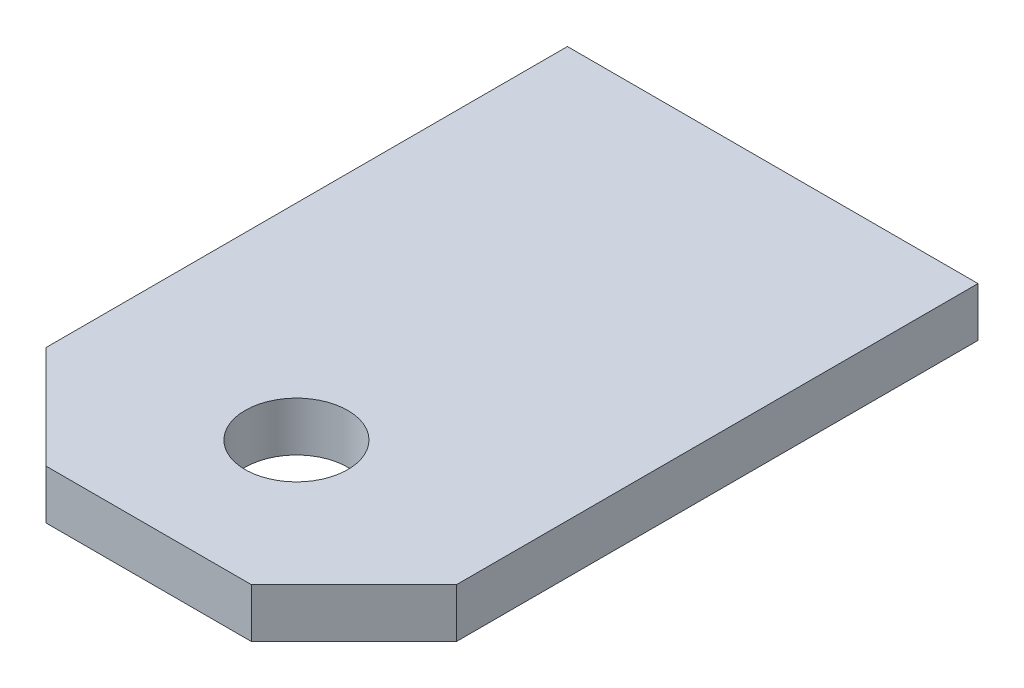
ISO-10303-21;
HEADER;
FILE_DESCRIPTION(('STEP AP214'),'2;1');
FILE_NAME('part.step','',(''),(''),'','','');
FILE_SCHEMA(('AUTOMOTIVE_DESIGN { 1 0 10303 214 1 1 1 1 }'));
ENDSEC;
DATA;
#1=APPLICATION_CONTEXT('core data for automotive mechanical design processes');
#2=APPLICATION_PROTOCOL_DEFINITION('international standard','automotive_design',2000,#1);
#3=PRODUCT_CONTEXT('',#1,'mechanical');
#4=PRODUCT('Part','Part','',(#3));
#5=PRODUCT_RELATED_PRODUCT_CATEGORY('part','',(#4));
#6=PRODUCT_DEFINITION_FORMATION('','',#4);
#7=PRODUCT_DEFINITION_CONTEXT('part definition',#1,'design');
#8=PRODUCT_DEFINITION('design','',#6,#7);
#9=PRODUCT_DEFINITION_SHAPE('','',#8);
#10=(LENGTH_UNIT() NAMED_UNIT(*) SI_UNIT(.MILLI.,.METRE.));
#11=(NAMED_UNIT(*) PLANE_ANGLE_UNIT() SI_UNIT($,.RADIAN.));
#12=(NAMED_UNIT(*) SI_UNIT($,.STERADIAN.) SOLID_ANGLE_UNIT());
#13=UNCERTAINTY_MEASURE_WITH_UNIT(LENGTH_MEASURE(1.E-05),#10,'distance_accuracy_value','');
#14=(GEOMETRIC_REPRESENTATION_CONTEXT(3) GLOBAL_UNCERTAINTY_ASSIGNED_CONTEXT((#13)) GLOBAL_UNIT_ASSIGNED_CONTEXT((#10,
#11,#12)) REPRESENTATION_CONTEXT('',''));
#15=CARTESIAN_POINT('',(0.,0.,0.));
#16=DIRECTION('',(0.,0.,1.));
#17=DIRECTION('',(1.,0.,0.));
#18=AXIS2_PLACEMENT_3D('',#15,#16,#17);
#19=CARTESIAN_POINT('',(0.,0.,2.54));
#20=DIRECTION('',(0.,-1.,0.));
#21=DIRECTION('',(1.,0.,0.));
#22=AXIS2_PLACEMENT_3D('',#19,#20,#21);
#23=CYLINDRICAL_SURFACE('',#22,0.79375);
#24=CARTESIAN_POINT('',(0.,0.762,2.54));
#25=DIRECTION('',(0.,-1.,0.));
#26=DIRECTION('',(1.,0.,0.));
#27=AXIS2_PLACEMENT_3D('',#24,#25,#26);
#28=CIRCLE('',#27,0.79375);
#29=CARTESIAN_POINT('',(-0.79375,0.762,2.54));
#30=VERTEX_POINT('',#29);
#31=EDGE_CURVE('E34',#30,#30,#28,.T.);
#32=ORIENTED_EDGE('',*,*,#31,.F.);
#33=EDGE_LOOP('',(#32));
#34=FACE_BOUND('',#33,.T.);
#35=CARTESIAN_POINT('',(0.,0.,2.54));
#36=DIRECTION('',(0.,1.,0.));
#37=DIRECTION('',(1.,0.,0.));
#38=AXIS2_PLACEMENT_3D('',#35,#36,#37);
#39=CIRCLE('',#38,0.79375);
#40=CARTESIAN_POINT('',(-0.79375,0.,2.54));
#41=VERTEX_POINT('',#40);
#42=EDGE_CURVE('E137',#41,#41,#39,.T.);
#43=ORIENTED_EDGE('',*,*,#42,.F.);
#44=EDGE_LOOP('',(#43));
#45=FACE_BOUND('',#44,.T.);
#46=ADVANCED_FACE('F16',(#34,#45),#23,.F.);
#47=CARTESIAN_POINT('',(3.175,0.,3.2385));
#48=DIRECTION('',(1.,0.,0.));
#49=DIRECTION('',(0.,0.,-1.));
#50=AXIS2_PLACEMENT_3D('',#47,#48,#49);
#51=PLANE('',#50);
#52=DIRECTION('',(0.,0.,-1.));
#53=VECTOR('',#52,1.);
#54=CARTESIAN_POINT('',(3.175,0.,3.2385));
#55=LINE('',#54,#53);
#56=CARTESIAN_POINT('',(3.175,0.,3.2385));
#57=VERTEX_POINT('',#56);
#58=CARTESIAN_POINT('',(3.175,0.,-4.826));
#59=VERTEX_POINT('',#58);
#60=EDGE_CURVE('E11',#57,#59,#55,.T.);
#61=ORIENTED_EDGE('',*,*,#60,.T.);
#62=DIRECTION('',(0.,1.,0.));
#63=VECTOR('',#62,1.);
#64=CARTESIAN_POINT('',(3.175,0.,-4.826));
#65=LINE('',#64,#63);
#66=CARTESIAN_POINT('',(3.175,0.762,-4.826));
#67=VERTEX_POINT('',#66);
#68=EDGE_CURVE('E27',#59,#67,#65,.T.);
#69=ORIENTED_EDGE('',*,*,#68,.T.);
#70=DIRECTION('',(0.,0.,-1.));
#71=VECTOR('',#70,1.);
#72=CARTESIAN_POINT('',(3.175,0.762,3.2385));
#73=LINE('',#72,#71);
#74=CARTESIAN_POINT('',(3.175,0.762,3.2385));
#75=VERTEX_POINT('',#74);
#76=EDGE_CURVE('E81',#75,#67,#73,.T.);
#77=ORIENTED_EDGE('',*,*,#76,.F.);
#78=DIRECTION('',(0.,1.,0.));
#79=VECTOR('',#78,1.);
#80=CARTESIAN_POINT('',(3.175,0.,3.2385));
#81=LINE('',#80,#79);
#82=EDGE_CURVE('E132',#57,#75,#81,.T.);
#83=ORIENTED_EDGE('',*,*,#82,.F.);
#84=EDGE_LOOP('',(#61,#69,#77,#83));
#85=FACE_BOUND('',#84,.T.);
#86=ADVANCED_FACE('F162',(#85),#51,.T.);
#87=CARTESIAN_POINT('',(1.5875,0.,4.826));
#88=DIRECTION('',(0.707106781186548,0.,0.707106781186547));
#89=DIRECTION('',(0.707106781186547,0.,-0.707106781186548));
#90=AXIS2_PLACEMENT_3D('',#87,#88,#89);
#91=PLANE('',#90);
#92=DIRECTION('',(0.707106781186548,0.,-0.707106781186548));
#93=VECTOR('',#92,1.);
#94=CARTESIAN_POINT('',(1.5875,0.,4.826));
#95=LINE('',#94,#93);
#96=CARTESIAN_POINT('',(1.5875,0.,4.826));
#97=VERTEX_POINT('',#96);
#98=EDGE_CURVE('E130',#97,#57,#95,.T.);
#99=ORIENTED_EDGE('',*,*,#98,.T.);
#100=ORIENTED_EDGE('',*,*,#82,.T.);
#101=DIRECTION('',(0.707106781186548,0.,-0.707106781186548));
#102=VECTOR('',#101,1.);
#103=CARTESIAN_POINT('',(1.5875,0.762,4.826));
#104=LINE('',#103,#102);
#105=CARTESIAN_POINT('',(1.5875,0.762,4.826));
#106=VERTEX_POINT('',#105);
#107=EDGE_CURVE('E128',#106,#75,#104,.T.);
#108=ORIENTED_EDGE('',*,*,#107,.F.);
#109=DIRECTION('',(0.,1.,0.));
#110=VECTOR('',#109,1.);
#111=CARTESIAN_POINT('',(1.5875,0.,4.826));
#112=LINE('',#111,#110);
#113=EDGE_CURVE('E58',#97,#106,#112,.T.);
#114=ORIENTED_EDGE('',*,*,#113,.F.);
#115=EDGE_LOOP('',(#99,#100,#108,#114));
#116=FACE_BOUND('',#115,.T.);
#117=ADVANCED_FACE('F18',(#116),#91,.T.);
#118=CARTESIAN_POINT('',(-1.5875,0.,4.826));
#119=DIRECTION('',(0.,0.,1.));
#120=DIRECTION('',(1.,0.,0.));
#121=AXIS2_PLACEMENT_3D('',#118,#119,#120);
#122=PLANE('',#121);
#123=DIRECTION('',(1.,0.,0.));
#124=VECTOR('',#123,1.);
#125=CARTESIAN_POINT('',(-1.5875,0.,4.826));
#126=LINE('',#125,#124);
#127=CARTESIAN_POINT('',(-1.5875,0.,4.826));
#128=VERTEX_POINT('',#127);
#129=EDGE_CURVE('E20',#128,#97,#126,.T.);
#130=ORIENTED_EDGE('',*,*,#129,.T.);
#131=ORIENTED_EDGE('',*,*,#113,.T.);
#132=DIRECTION('',(1.,0.,0.));
#133=VECTOR('',#132,1.);
#134=CARTESIAN_POINT('',(-1.5875,0.762,4.826));
#135=LINE('',#134,#133);
#136=CARTESIAN_POINT('',(-1.5875,0.762,4.826));
#137=VERTEX_POINT('',#136);
#138=EDGE_CURVE('E65',#137,#106,#135,.T.);
#139=ORIENTED_EDGE('',*,*,#138,.F.);
#140=DIRECTION('',(0.,1.,0.));
#141=VECTOR('',#140,1.);
#142=CARTESIAN_POINT('',(-1.5875,0.,4.826));
#143=LINE('',#142,#141);
#144=EDGE_CURVE('E112',#128,#137,#143,.T.);
#145=ORIENTED_EDGE('',*,*,#144,.F.);
#146=EDGE_LOOP('',(#130,#131,#139,#145));
#147=FACE_BOUND('',#146,.T.);
#148=ADVANCED_FACE('F170',(#147),#122,.T.);
#149=CARTESIAN_POINT('',(-3.175,0.,3.2385));
#150=DIRECTION('',(-0.707106781186547,0.,0.707106781186548));
#151=DIRECTION('',(0.707106781186548,0.,0.707106781186547));
#152=AXIS2_PLACEMENT_3D('',#149,#150,#151);
#153=PLANE('',#152);
#154=DIRECTION('',(0.707106781186548,0.,0.707106781186548));
#155=VECTOR('',#154,1.);
#156=CARTESIAN_POINT('',(-3.175,0.,3.2385));
#157=LINE('',#156,#155);
#158=CARTESIAN_POINT('',(-3.175,0.,3.2385));
#159=VERTEX_POINT('',#158);
#160=EDGE_CURVE('E97',#159,#128,#157,.T.);
#161=ORIENTED_EDGE('',*,*,#160,.T.);
#162=ORIENTED_EDGE('',*,*,#144,.T.);
#163=DIRECTION('',(0.707106781186548,0.,0.707106781186548));
#164=VECTOR('',#163,1.);
#165=CARTESIAN_POINT('',(-3.175,0.762,3.2385));
#166=LINE('',#165,#164);
#167=CARTESIAN_POINT('',(-3.175,0.762,3.2385));
#168=VERTEX_POINT('',#167);
#169=EDGE_CURVE('E91',#168,#137,#166,.T.);
#170=ORIENTED_EDGE('',*,*,#169,.F.);
#171=DIRECTION('',(0.,1.,0.));
#172=VECTOR('',#171,1.);
#173=CARTESIAN_POINT('',(-3.175,0.,3.2385));
#174=LINE('',#173,#172);
#175=EDGE_CURVE('E94',#159,#168,#174,.T.);
#176=ORIENTED_EDGE('',*,*,#175,.F.);
#177=EDGE_LOOP('',(#161,#162,#170,#176));
#178=FACE_BOUND('',#177,.T.);
#179=ADVANCED_FACE('F96',(#178),#153,.T.);
#180=CARTESIAN_POINT('',(-3.175,0.,-4.826));
#181=DIRECTION('',(-1.,0.,0.));
#182=DIRECTION('',(0.,0.,1.));
#183=AXIS2_PLACEMENT_3D('',#180,#181,#182);
#184=PLANE('',#183);
#185=DIRECTION('',(0.,0.,1.));
#186=VECTOR('',#185,1.);
#187=CARTESIAN_POINT('',(-3.175,0.,-4.826));
#188=LINE('',#187,#186);
#189=CARTESIAN_POINT('',(-3.175,0.,-4.826));
#190=VERTEX_POINT('',#189);
#191=EDGE_CURVE('E102',#190,#159,#188,.T.);
#192=ORIENTED_EDGE('',*,*,#191,.T.);
#193=ORIENTED_EDGE('',*,*,#175,.T.);
#194=DIRECTION('',(0.,0.,1.));
#195=VECTOR('',#194,1.);
#196=CARTESIAN_POINT('',(-3.175,0.762,-4.826));
#197=LINE('',#196,#195);
#198=CARTESIAN_POINT('',(-3.175,0.762,-4.826));
#199=VERTEX_POINT('',#198);
#200=EDGE_CURVE('E146',#199,#168,#197,.T.);
#201=ORIENTED_EDGE('',*,*,#200,.F.);
#202=DIRECTION('',(0.,1.,0.));
#203=VECTOR('',#202,1.);
#204=CARTESIAN_POINT('',(-3.175,0.,-4.826));
#205=LINE('',#204,#203);
#206=EDGE_CURVE('E116',#190,#199,#205,.T.);
#207=ORIENTED_EDGE('',*,*,#206,.F.);
#208=EDGE_LOOP('',(#192,#193,#201,#207));
#209=FACE_BOUND('',#208,.T.);
#210=ADVANCED_FACE('F114',(#209),#184,.T.);
#211=CARTESIAN_POINT('',(3.175,0.,-4.826));
#212=DIRECTION('',(0.,0.,-1.));
#213=DIRECTION('',(-1.,0.,0.));
#214=AXIS2_PLACEMENT_3D('',#211,#212,#213);
#215=PLANE('',#214);
#216=DIRECTION('',(-1.,0.,0.));
#217=VECTOR('',#216,1.);
#218=CARTESIAN_POINT('',(3.175,0.,-4.826));
#219=LINE('',#218,#217);
#220=EDGE_CURVE('E103',#59,#190,#219,.T.);
#221=ORIENTED_EDGE('',*,*,#220,.T.);
#222=ORIENTED_EDGE('',*,*,#206,.T.);
#223=DIRECTION('',(-1.,0.,0.));
#224=VECTOR('',#223,1.);
#225=CARTESIAN_POINT('',(3.175,0.762,-4.826));
#226=LINE('',#225,#224);
#227=EDGE_CURVE('E155',#67,#199,#226,.T.);
#228=ORIENTED_EDGE('',*,*,#227,.F.);
#229=ORIENTED_EDGE('',*,*,#68,.F.);
#230=EDGE_LOOP('',(#221,#222,#228,#229));
#231=FACE_BOUND('',#230,.T.);
#232=ADVANCED_FACE('F160',(#231),#215,.T.);
#233=CARTESIAN_POINT('',(0.,0.762,-0.332390602169297));
#234=DIRECTION('',(0.,-1.,0.));
#235=DIRECTION('',(0.,0.,-1.));
#236=AXIS2_PLACEMENT_3D('',#233,#234,#235);
#237=PLANE('',#236);
#238=ORIENTED_EDGE('',*,*,#31,.T.);
#239=EDGE_LOOP('',(#238));
#240=FACE_BOUND('',#239,.T.);
#241=ORIENTED_EDGE('',*,*,#227,.T.);
#242=ORIENTED_EDGE('',*,*,#200,.T.);
#243=ORIENTED_EDGE('',*,*,#169,.T.);
#244=ORIENTED_EDGE('',*,*,#138,.T.);
#245=ORIENTED_EDGE('',*,*,#107,.T.);
#246=ORIENTED_EDGE('',*,*,#76,.T.);
#247=EDGE_LOOP('',(#241,#242,#243,#244,#245,#246));
#248=FACE_BOUND('',#247,.T.);
#249=ADVANCED_FACE('F159',(#240,#248),#237,.F.);
#250=CARTESIAN_POINT('',(0.,0.,-0.332390602169297));
#251=DIRECTION('',(0.,-1.,0.));
#252=DIRECTION('',(0.,0.,-1.));
#253=AXIS2_PLACEMENT_3D('',#250,#251,#252);
#254=PLANE('',#253);
#255=ORIENTED_EDGE('',*,*,#42,.T.);
#256=EDGE_LOOP('',(#255));
#257=FACE_BOUND('',#256,.T.);
#258=ORIENTED_EDGE('',*,*,#220,.F.);
#259=ORIENTED_EDGE('',*,*,#60,.F.);
#260=ORIENTED_EDGE('',*,*,#98,.F.);
#261=ORIENTED_EDGE('',*,*,#129,.F.);
#262=ORIENTED_EDGE('',*,*,#160,.F.);
#263=ORIENTED_EDGE('',*,*,#191,.F.);
#264=EDGE_LOOP('',(#258,#259,#260,#261,#262,#263));
#265=FACE_BOUND('',#264,.T.);
#266=ADVANCED_FACE('F109',(#257,#265),#254,.T.);
#267=CLOSED_SHELL('',(#46,#86,#117,#148,#179,#210,#232,#249,#266));
#268=MANIFOLD_SOLID_BREP('B1',#267);
#269=ADVANCED_BREP_SHAPE_REPRESENTATION('',(#18,#268),#14);
#270=SHAPE_DEFINITION_REPRESENTATION(#9,#269);
ENDSEC;
END-ISO-10303-21;
